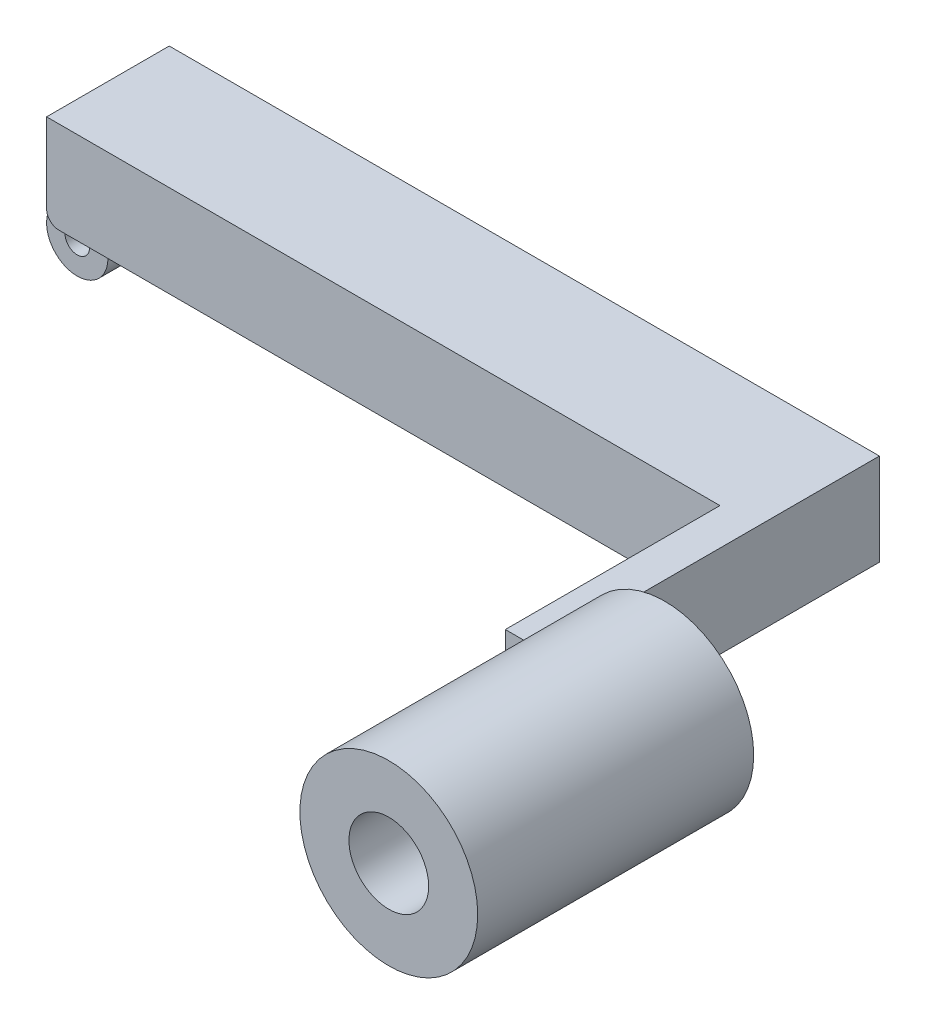
ISO-10303-21;
HEADER;
FILE_DESCRIPTION(('STEP AP214'),'2;1');
FILE_NAME('part.step','',(''),(''),'','','');
FILE_SCHEMA(('AUTOMOTIVE_DESIGN { 1 0 10303 214 1 1 1 1 }'));
ENDSEC;
DATA;
#1=APPLICATION_CONTEXT('core data for automotive mechanical design processes');
#2=APPLICATION_PROTOCOL_DEFINITION('international standard','automotive_design',2000,#1);
#3=PRODUCT_CONTEXT('',#1,'mechanical');
#4=PRODUCT('Part','Part','',(#3));
#5=PRODUCT_RELATED_PRODUCT_CATEGORY('part','',(#4));
#6=PRODUCT_DEFINITION_FORMATION('','',#4);
#7=PRODUCT_DEFINITION_CONTEXT('part definition',#1,'design');
#8=PRODUCT_DEFINITION('design','',#6,#7);
#9=PRODUCT_DEFINITION_SHAPE('','',#8);
#10=(LENGTH_UNIT() NAMED_UNIT(*) SI_UNIT(.MILLI.,.METRE.));
#11=(NAMED_UNIT(*) PLANE_ANGLE_UNIT() SI_UNIT($,.RADIAN.));
#12=(NAMED_UNIT(*) SI_UNIT($,.STERADIAN.) SOLID_ANGLE_UNIT());
#13=UNCERTAINTY_MEASURE_WITH_UNIT(LENGTH_MEASURE(1.E-05),#10,'distance_accuracy_value','');
#14=(GEOMETRIC_REPRESENTATION_CONTEXT(3) GLOBAL_UNCERTAINTY_ASSIGNED_CONTEXT((#13)) GLOBAL_UNIT_ASSIGNED_CONTEXT((#10,
#11,#12)) REPRESENTATION_CONTEXT('',''));
#15=CARTESIAN_POINT('',(0.,0.,0.));
#16=DIRECTION('',(0.,0.,1.));
#17=DIRECTION('',(1.,0.,0.));
#18=AXIS2_PLACEMENT_3D('',#15,#16,#17);
#19=CARTESIAN_POINT('',(115.8,7.5,10.));
#20=DIRECTION('',(0.,-1.,0.));
#21=DIRECTION('',(0.,0.,-1.));
#22=AXIS2_PLACEMENT_3D('',#19,#20,#21);
#23=PLANE('',#22);
#24=DIRECTION('',(0.,0.,-1.));
#25=VECTOR('',#24,1.);
#26=CARTESIAN_POINT('',(113.390326354009,7.5,80.));
#27=LINE('',#26,#25);
#28=CARTESIAN_POINT('',(113.390326354009,7.5,35.));
#29=VERTEX_POINT('',#28);
#30=CARTESIAN_POINT('',(113.390326354009,7.5,45.));
#31=VERTEX_POINT('',#30);
#32=EDGE_CURVE('E179',#29,#31,#27,.F.);
#33=ORIENTED_EDGE('',*,*,#32,.F.);
#34=DIRECTION('',(-1.,0.,0.));
#35=VECTOR('',#34,1.);
#36=CARTESIAN_POINT('',(115.8,7.5,35.));
#37=LINE('',#36,#35);
#38=CARTESIAN_POINT('',(115.8,7.5,35.));
#39=VERTEX_POINT('',#38);
#40=EDGE_CURVE('E185',#39,#29,#37,.T.);
#41=ORIENTED_EDGE('',*,*,#40,.F.);
#42=DIRECTION('',(0.,0.,1.));
#43=VECTOR('',#42,1.);
#44=CARTESIAN_POINT('',(115.8,7.5,10.));
#45=LINE('',#44,#43);
#46=CARTESIAN_POINT('',(115.8,7.5,-10.));
#47=VERTEX_POINT('',#46);
#48=EDGE_CURVE('E207',#47,#39,#45,.T.);
#49=ORIENTED_EDGE('',*,*,#48,.F.);
#50=DIRECTION('',(-1.,0.,0.));
#51=VECTOR('',#50,1.);
#52=CARTESIAN_POINT('',(115.8,7.5,-10.));
#53=LINE('',#52,#51);
#54=CARTESIAN_POINT('',(0.,7.5,-10.));
#55=VERTEX_POINT('',#54);
#56=EDGE_CURVE('E227',#47,#55,#53,.T.);
#57=ORIENTED_EDGE('',*,*,#56,.T.);
#58=DIRECTION('',(0.,0.,1.));
#59=VECTOR('',#58,1.);
#60=CARTESIAN_POINT('',(0.,7.5,10.));
#61=LINE('',#60,#59);
#62=CARTESIAN_POINT('',(0.,7.5,10.));
#63=VERTEX_POINT('',#62);
#64=EDGE_CURVE('E215',#55,#63,#61,.T.);
#65=ORIENTED_EDGE('',*,*,#64,.T.);
#66=DIRECTION('',(-1.,0.,0.));
#67=VECTOR('',#66,1.);
#68=CARTESIAN_POINT('',(115.8,7.5,10.));
#69=LINE('',#68,#67);
#70=CARTESIAN_POINT('',(109.8,7.5,10.));
#71=VERTEX_POINT('',#70);
#72=EDGE_CURVE('E225',#71,#63,#69,.T.);
#73=ORIENTED_EDGE('',*,*,#72,.F.);
#74=DIRECTION('',(0.,0.,-1.));
#75=VECTOR('',#74,1.);
#76=CARTESIAN_POINT('',(109.8,7.5,45.));
#77=LINE('',#76,#75);
#78=CARTESIAN_POINT('',(109.8,7.5,45.));
#79=VERTEX_POINT('',#78);
#80=EDGE_CURVE('E200',#79,#71,#77,.T.);
#81=ORIENTED_EDGE('',*,*,#80,.F.);
#82=DIRECTION('',(-1.,0.,0.));
#83=VECTOR('',#82,1.);
#84=CARTESIAN_POINT('',(115.8,7.5,45.));
#85=LINE('',#84,#83);
#86=EDGE_CURVE('E189',#31,#79,#85,.T.);
#87=ORIENTED_EDGE('',*,*,#86,.F.);
#88=EDGE_LOOP('',(#33,#41,#49,#57,#65,#73,#81,#87));
#89=FACE_BOUND('',#88,.T.);
#90=ADVANCED_FACE('F37',(#89),#23,.F.);
#91=CARTESIAN_POINT('',(115.8,-7.5,10.));
#92=DIRECTION('',(0.,1.,0.));
#93=DIRECTION('',(0.,0.,1.));
#94=AXIS2_PLACEMENT_3D('',#91,#92,#93);
#95=PLANE('',#94);
#96=DIRECTION('',(-1.,0.,0.));
#97=VECTOR('',#96,1.);
#98=CARTESIAN_POINT('',(0.,-7.5,-5.));
#99=LINE('',#98,#97);
#100=CARTESIAN_POINT('',(5.,-7.5,-5.));
#101=VERTEX_POINT('',#100);
#102=CARTESIAN_POINT('',(2.,-7.5,-5.));
#103=VERTEX_POINT('',#102);
#104=EDGE_CURVE('E155',#101,#103,#99,.T.);
#105=ORIENTED_EDGE('',*,*,#104,.T.);
#106=DIRECTION('',(0.,0.,-1.));
#107=VECTOR('',#106,1.);
#108=CARTESIAN_POINT('',(2.,-7.5,-10.));
#109=LINE('',#108,#107);
#110=CARTESIAN_POINT('',(2.00000000000003,-7.5,-10.));
#111=VERTEX_POINT('',#110);
#112=EDGE_CURVE('E239',#103,#111,#109,.T.);
#113=ORIENTED_EDGE('',*,*,#112,.T.);
#114=DIRECTION('',(-1.,0.,0.));
#115=VECTOR('',#114,1.);
#116=CARTESIAN_POINT('',(115.8,-7.5,-10.));
#117=LINE('',#116,#115);
#118=CARTESIAN_POINT('',(115.8,-7.5,-10.));
#119=VERTEX_POINT('',#118);
#120=EDGE_CURVE('E213',#119,#111,#117,.T.);
#121=ORIENTED_EDGE('',*,*,#120,.F.);
#122=DIRECTION('',(0.,0.,-1.));
#123=VECTOR('',#122,1.);
#124=CARTESIAN_POINT('',(115.8,-7.5,10.));
#125=LINE('',#124,#123);
#126=CARTESIAN_POINT('',(115.8,-7.5,35.));
#127=VERTEX_POINT('',#126);
#128=EDGE_CURVE('E211',#127,#119,#125,.T.);
#129=ORIENTED_EDGE('',*,*,#128,.F.);
#130=DIRECTION('',(1.,0.,0.));
#131=VECTOR('',#130,1.);
#132=CARTESIAN_POINT('',(115.8,-7.5,35.));
#133=LINE('',#132,#131);
#134=CARTESIAN_POINT('',(113.390326354009,-7.5,35.));
#135=VERTEX_POINT('',#134);
#136=EDGE_CURVE('E182',#135,#127,#133,.T.);
#137=ORIENTED_EDGE('',*,*,#136,.F.);
#138=DIRECTION('',(0.,0.,-1.));
#139=VECTOR('',#138,1.);
#140=CARTESIAN_POINT('',(113.390326354009,-7.5,80.));
#141=LINE('',#140,#139);
#142=CARTESIAN_POINT('',(113.390326354009,-7.5,45.));
#143=VERTEX_POINT('',#142);
#144=EDGE_CURVE('E176',#143,#135,#141,.T.);
#145=ORIENTED_EDGE('',*,*,#144,.F.);
#146=DIRECTION('',(1.,0.,0.));
#147=VECTOR('',#146,1.);
#148=CARTESIAN_POINT('',(115.8,-7.5,45.));
#149=LINE('',#148,#147);
#150=CARTESIAN_POINT('',(109.8,-7.5,45.));
#151=VERTEX_POINT('',#150);
#152=EDGE_CURVE('E193',#151,#143,#149,.T.);
#153=ORIENTED_EDGE('',*,*,#152,.F.);
#154=DIRECTION('',(0.,0.,-1.));
#155=VECTOR('',#154,1.);
#156=CARTESIAN_POINT('',(109.8,-7.5,45.));
#157=LINE('',#156,#155);
#158=CARTESIAN_POINT('',(109.8,-7.5,10.));
#159=VERTEX_POINT('',#158);
#160=EDGE_CURVE('E195',#151,#159,#157,.T.);
#161=ORIENTED_EDGE('',*,*,#160,.T.);
#162=DIRECTION('',(-1.,0.,0.));
#163=VECTOR('',#162,1.);
#164=CARTESIAN_POINT('',(115.8,-7.5,10.));
#165=LINE('',#164,#163);
#166=CARTESIAN_POINT('',(2.00000000000003,-7.5,10.));
#167=VERTEX_POINT('',#166);
#168=EDGE_CURVE('E222',#159,#167,#165,.T.);
#169=ORIENTED_EDGE('',*,*,#168,.T.);
#170=DIRECTION('',(0.,0.,-1.));
#171=VECTOR('',#170,1.);
#172=CARTESIAN_POINT('',(2.,-7.5,5.));
#173=LINE('',#172,#171);
#174=CARTESIAN_POINT('',(2.,-7.5,5.));
#175=VERTEX_POINT('',#174);
#176=EDGE_CURVE('E236',#167,#175,#173,.T.);
#177=ORIENTED_EDGE('',*,*,#176,.T.);
#178=DIRECTION('',(-1.,0.,0.));
#179=VECTOR('',#178,1.);
#180=CARTESIAN_POINT('',(0.,-7.5,5.));
#181=LINE('',#180,#179);
#182=CARTESIAN_POINT('',(5.,-7.5,5.));
#183=VERTEX_POINT('',#182);
#184=EDGE_CURVE('E147',#183,#175,#181,.T.);
#185=ORIENTED_EDGE('',*,*,#184,.F.);
#186=DIRECTION('',(0.,0.,-1.));
#187=VECTOR('',#186,1.);
#188=CARTESIAN_POINT('',(5.,-7.5,5.));
#189=LINE('',#188,#187);
#190=EDGE_CURVE('E145',#183,#101,#189,.T.);
#191=ORIENTED_EDGE('',*,*,#190,.T.);
#192=EDGE_LOOP('',(#105,#113,#121,#129,#137,#145,#153,#161,#169,#177,#185,#191));
#193=FACE_BOUND('',#192,.T.);
#194=ADVANCED_FACE('F260',(#193),#95,.F.);
#195=CARTESIAN_POINT('',(115.8,0.,0.));
#196=DIRECTION('',(-1.,0.,0.));
#197=DIRECTION('',(0.,0.,1.));
#198=AXIS2_PLACEMENT_3D('',#195,#196,#197);
#199=PLANE('',#198);
#200=DIRECTION('',(0.,1.,0.));
#201=VECTOR('',#200,1.);
#202=CARTESIAN_POINT('',(115.8,0.,35.));
#203=LINE('',#202,#201);
#204=EDGE_CURVE('E233',#127,#39,#203,.T.);
#205=ORIENTED_EDGE('',*,*,#204,.F.);
#206=ORIENTED_EDGE('',*,*,#128,.T.);
#207=DIRECTION('',(0.,1.,0.));
#208=VECTOR('',#207,1.);
#209=CARTESIAN_POINT('',(115.8,-7.5,-10.));
#210=LINE('',#209,#208);
#211=EDGE_CURVE('E204',#119,#47,#210,.T.);
#212=ORIENTED_EDGE('',*,*,#211,.T.);
#213=ORIENTED_EDGE('',*,*,#48,.T.);
#214=EDGE_LOOP('',(#205,#206,#212,#213));
#215=FACE_BOUND('',#214,.T.);
#216=ADVANCED_FACE('F277',(#215),#199,.F.);
#217=CARTESIAN_POINT('',(115.8,-7.5,10.));
#218=DIRECTION('',(0.,0.,-1.));
#219=DIRECTION('',(-1.,0.,0.));
#220=AXIS2_PLACEMENT_3D('',#217,#218,#219);
#221=PLANE('',#220);
#222=DIRECTION('',(0.,-1.,0.));
#223=VECTOR('',#222,1.);
#224=CARTESIAN_POINT('',(0.,-7.5,10.));
#225=LINE('',#224,#223);
#226=CARTESIAN_POINT('',(0.,-5.5,10.));
#227=VERTEX_POINT('',#226);
#228=EDGE_CURVE('E208',#63,#227,#225,.T.);
#229=ORIENTED_EDGE('',*,*,#228,.T.);
#230=CARTESIAN_POINT('',(2.,-5.5,10.));
#231=DIRECTION('',(0.,0.,-1.));
#232=DIRECTION('',(-1.,0.,0.));
#233=AXIS2_PLACEMENT_3D('',#230,#231,#232);
#234=CIRCLE('',#233,2.);
#235=EDGE_CURVE('E250',#227,#167,#234,.F.);
#236=ORIENTED_EDGE('',*,*,#235,.T.);
#237=ORIENTED_EDGE('',*,*,#168,.F.);
#238=DIRECTION('',(0.,-1.,0.));
#239=VECTOR('',#238,1.);
#240=CARTESIAN_POINT('',(109.8,7.5,10.));
#241=LINE('',#240,#239);
#242=EDGE_CURVE('E188',#71,#159,#241,.T.);
#243=ORIENTED_EDGE('',*,*,#242,.F.);
#244=ORIENTED_EDGE('',*,*,#72,.T.);
#245=EDGE_LOOP('',(#229,#236,#237,#243,#244));
#246=FACE_BOUND('',#245,.T.);
#247=ADVANCED_FACE('F295',(#246),#221,.F.);
#248=CARTESIAN_POINT('',(115.8,-7.5,-10.));
#249=DIRECTION('',(0.,0.,1.));
#250=DIRECTION('',(1.,0.,0.));
#251=AXIS2_PLACEMENT_3D('',#248,#249,#250);
#252=PLANE('',#251);
#253=ORIENTED_EDGE('',*,*,#120,.T.);
#254=CARTESIAN_POINT('',(2.,-5.5,-10.));
#255=DIRECTION('',(0.,0.,1.));
#256=DIRECTION('',(1.,0.,0.));
#257=AXIS2_PLACEMENT_3D('',#254,#255,#256);
#258=CIRCLE('',#257,2.);
#259=CARTESIAN_POINT('',(0.,-5.5,-10.));
#260=VERTEX_POINT('',#259);
#261=EDGE_CURVE('E242',#111,#260,#258,.F.);
#262=ORIENTED_EDGE('',*,*,#261,.T.);
#263=DIRECTION('',(0.,1.,0.));
#264=VECTOR('',#263,1.);
#265=CARTESIAN_POINT('',(0.,-7.5,-10.));
#266=LINE('',#265,#264);
#267=EDGE_CURVE('E203',#260,#55,#266,.T.);
#268=ORIENTED_EDGE('',*,*,#267,.T.);
#269=ORIENTED_EDGE('',*,*,#56,.F.);
#270=ORIENTED_EDGE('',*,*,#211,.F.);
#271=EDGE_LOOP('',(#253,#262,#268,#269,#270));
#272=FACE_BOUND('',#271,.T.);
#273=ADVANCED_FACE('F267',(#272),#252,.F.);
#274=CARTESIAN_POINT('',(0.,0.,0.));
#275=DIRECTION('',(-1.,0.,0.));
#276=DIRECTION('',(0.,0.,1.));
#277=AXIS2_PLACEMENT_3D('',#274,#275,#276);
#278=PLANE('',#277);
#279=ORIENTED_EDGE('',*,*,#267,.F.);
#280=DIRECTION('',(0.,0.,-1.));
#281=VECTOR('',#280,1.);
#282=CARTESIAN_POINT('',(0.,-5.5,-5.));
#283=LINE('',#282,#281);
#284=CARTESIAN_POINT('',(0.,-5.5,-5.));
#285=VERTEX_POINT('',#284);
#286=EDGE_CURVE('E248',#260,#285,#283,.F.);
#287=ORIENTED_EDGE('',*,*,#286,.T.);
#288=DIRECTION('',(0.,-1.,0.));
#289=VECTOR('',#288,1.);
#290=CARTESIAN_POINT('',(0.,-12.5,-5.));
#291=LINE('',#290,#289);
#292=CARTESIAN_POINT('',(0.,-7.5,-5.));
#293=VERTEX_POINT('',#292);
#294=EDGE_CURVE('E59',#285,#293,#291,.T.);
#295=ORIENTED_EDGE('',*,*,#294,.T.);
#296=DIRECTION('',(0.,0.,-1.));
#297=VECTOR('',#296,1.);
#298=CARTESIAN_POINT('',(0.,-7.5,5.));
#299=LINE('',#298,#297);
#300=CARTESIAN_POINT('',(0.,-7.5,5.));
#301=VERTEX_POINT('',#300);
#302=EDGE_CURVE('E164',#301,#293,#299,.T.);
#303=ORIENTED_EDGE('',*,*,#302,.F.);
#304=DIRECTION('',(0.,1.,0.));
#305=VECTOR('',#304,1.);
#306=CARTESIAN_POINT('',(0.,0.,5.));
#307=LINE('',#306,#305);
#308=CARTESIAN_POINT('',(0.,-5.5,5.));
#309=VERTEX_POINT('',#308);
#310=EDGE_CURVE('E51',#301,#309,#307,.T.);
#311=ORIENTED_EDGE('',*,*,#310,.T.);
#312=DIRECTION('',(0.,0.,-1.));
#313=VECTOR('',#312,1.);
#314=CARTESIAN_POINT('',(0.,-5.5,10.));
#315=LINE('',#314,#313);
#316=EDGE_CURVE('E244',#309,#227,#315,.F.);
#317=ORIENTED_EDGE('',*,*,#316,.T.);
#318=ORIENTED_EDGE('',*,*,#228,.F.);
#319=ORIENTED_EDGE('',*,*,#64,.F.);
#320=EDGE_LOOP('',(#279,#287,#295,#303,#311,#317,#318,#319));
#321=FACE_BOUND('',#320,.T.);
#322=ADVANCED_FACE('F272',(#321),#278,.T.);
#323=CARTESIAN_POINT('',(109.8,7.5,45.));
#324=DIRECTION('',(1.,0.,0.));
#325=DIRECTION('',(0.,0.,-1.));
#326=AXIS2_PLACEMENT_3D('',#323,#324,#325);
#327=PLANE('',#326);
#328=ORIENTED_EDGE('',*,*,#242,.T.);
#329=ORIENTED_EDGE('',*,*,#160,.F.);
#330=DIRECTION('',(0.,-1.,0.));
#331=VECTOR('',#330,1.);
#332=CARTESIAN_POINT('',(109.8,7.5,45.));
#333=LINE('',#332,#331);
#334=EDGE_CURVE('E191',#79,#151,#333,.T.);
#335=ORIENTED_EDGE('',*,*,#334,.F.);
#336=ORIENTED_EDGE('',*,*,#80,.T.);
#337=EDGE_LOOP('',(#328,#329,#335,#336));
#338=FACE_BOUND('',#337,.T.);
#339=ADVANCED_FACE('F293',(#338),#327,.F.);
#340=CARTESIAN_POINT('',(0.,0.,45.));
#341=DIRECTION('',(0.,0.,-1.));
#342=DIRECTION('',(-1.,0.,0.));
#343=AXIS2_PLACEMENT_3D('',#340,#341,#342);
#344=PLANE('',#343);
#345=CARTESIAN_POINT('',(125.8,0.,45.));
#346=DIRECTION('',(0.,0.,-1.));
#347=DIRECTION('',(-1.,0.,0.));
#348=AXIS2_PLACEMENT_3D('',#345,#346,#347);
#349=CIRCLE('',#348,14.5);
#350=EDGE_CURVE('E230',#31,#143,#349,.F.);
#351=ORIENTED_EDGE('',*,*,#350,.F.);
#352=ORIENTED_EDGE('',*,*,#86,.T.);
#353=ORIENTED_EDGE('',*,*,#334,.T.);
#354=ORIENTED_EDGE('',*,*,#152,.T.);
#355=EDGE_LOOP('',(#351,#352,#353,#354));
#356=FACE_BOUND('',#355,.T.);
#357=ADVANCED_FACE('F288',(#356),#344,.F.);
#358=CARTESIAN_POINT('',(125.8,0.,35.));
#359=DIRECTION('',(0.,0.,1.));
#360=DIRECTION('',(1.,0.,0.));
#361=AXIS2_PLACEMENT_3D('',#358,#359,#360);
#362=PLANE('',#361);
#363=CARTESIAN_POINT('',(125.8,0.,35.));
#364=DIRECTION('',(0.,0.,1.));
#365=DIRECTION('',(1.,0.,0.));
#366=AXIS2_PLACEMENT_3D('',#363,#364,#365);
#367=CIRCLE('',#366,6.50000000000002);
#368=CARTESIAN_POINT('',(132.3,0.,35.));
#369=VERTEX_POINT('',#368);
#370=EDGE_CURVE('E159',#369,#369,#367,.T.);
#371=ORIENTED_EDGE('',*,*,#370,.T.);
#372=EDGE_LOOP('',(#371));
#373=FACE_BOUND('',#372,.T.);
#374=ORIENTED_EDGE('',*,*,#204,.T.);
#375=ORIENTED_EDGE('',*,*,#40,.T.);
#376=CARTESIAN_POINT('',(125.8,0.,35.));
#377=DIRECTION('',(0.,0.,1.));
#378=DIRECTION('',(1.,0.,0.));
#379=AXIS2_PLACEMENT_3D('',#376,#377,#378);
#380=CIRCLE('',#379,14.5);
#381=EDGE_CURVE('E162',#135,#29,#380,.T.);
#382=ORIENTED_EDGE('',*,*,#381,.F.);
#383=ORIENTED_EDGE('',*,*,#136,.T.);
#384=EDGE_LOOP('',(#374,#375,#382,#383));
#385=FACE_BOUND('',#384,.T.);
#386=ADVANCED_FACE('F282',(#373,#385),#362,.F.);
#387=CARTESIAN_POINT('',(125.8,0.,80.));
#388=DIRECTION('',(0.,0.,-1.));
#389=DIRECTION('',(-1.,0.,0.));
#390=AXIS2_PLACEMENT_3D('',#387,#388,#389);
#391=CYLINDRICAL_SURFACE('',#390,14.5);
#392=CARTESIAN_POINT('',(125.8,0.,80.));
#393=DIRECTION('',(0.,0.,1.));
#394=DIRECTION('',(1.,0.,0.));
#395=AXIS2_PLACEMENT_3D('',#392,#393,#394);
#396=CIRCLE('',#395,14.5);
#397=CARTESIAN_POINT('',(140.3,0.,80.));
#398=VERTEX_POINT('',#397);
#399=EDGE_CURVE('E173',#398,#398,#396,.T.);
#400=ORIENTED_EDGE('',*,*,#399,.F.);
#401=EDGE_LOOP('',(#400));
#402=FACE_BOUND('',#401,.T.);
#403=ORIENTED_EDGE('',*,*,#381,.T.);
#404=ORIENTED_EDGE('',*,*,#32,.T.);
#405=ORIENTED_EDGE('',*,*,#350,.T.);
#406=ORIENTED_EDGE('',*,*,#144,.T.);
#407=EDGE_LOOP('',(#403,#404,#405,#406));
#408=FACE_BOUND('',#407,.T.);
#409=ADVANCED_FACE('F284',(#402,#408),#391,.T.);
#410=CARTESIAN_POINT('',(125.8,0.,80.));
#411=DIRECTION('',(0.,0.,1.));
#412=DIRECTION('',(1.,0.,0.));
#413=AXIS2_PLACEMENT_3D('',#410,#411,#412);
#414=PLANE('',#413);
#415=ORIENTED_EDGE('',*,*,#399,.T.);
#416=EDGE_LOOP('',(#415));
#417=FACE_BOUND('',#416,.T.);
#418=CARTESIAN_POINT('',(125.8,0.,80.));
#419=DIRECTION('',(0.,0.,1.));
#420=DIRECTION('',(1.,0.,0.));
#421=AXIS2_PLACEMENT_3D('',#418,#419,#420);
#422=CIRCLE('',#421,6.50000000000002);
#423=CARTESIAN_POINT('',(132.3,0.,80.));
#424=VERTEX_POINT('',#423);
#425=EDGE_CURVE('E170',#424,#424,#422,.T.);
#426=ORIENTED_EDGE('',*,*,#425,.F.);
#427=EDGE_LOOP('',(#426));
#428=FACE_BOUND('',#427,.T.);
#429=ADVANCED_FACE('F321',(#417,#428),#414,.T.);
#430=CARTESIAN_POINT('',(125.8,0.,80.));
#431=DIRECTION('',(0.,0.,-1.));
#432=DIRECTION('',(-1.,0.,0.));
#433=AXIS2_PLACEMENT_3D('',#430,#431,#432);
#434=CYLINDRICAL_SURFACE('',#433,6.50000000000002);
#435=ORIENTED_EDGE('',*,*,#425,.T.);
#436=EDGE_LOOP('',(#435));
#437=FACE_BOUND('',#436,.T.);
#438=ORIENTED_EDGE('',*,*,#370,.F.);
#439=EDGE_LOOP('',(#438));
#440=FACE_BOUND('',#439,.T.);
#441=ADVANCED_FACE('F314',(#437,#440),#434,.F.);
#442=CARTESIAN_POINT('',(0.,-12.5,5.));
#443=DIRECTION('',(0.,0.,1.));
#444=DIRECTION('',(1.,0.,0.));
#445=AXIS2_PLACEMENT_3D('',#442,#443,#444);
#446=PLANE('',#445);
#447=CARTESIAN_POINT('',(0.,-12.5,5.));
#448=DIRECTION('',(0.,0.,1.));
#449=DIRECTION('',(1.,0.,0.));
#450=AXIS2_PLACEMENT_3D('',#447,#448,#449);
#451=CIRCLE('',#450,5.);
#452=CARTESIAN_POINT('',(5.,-12.5,5.));
#453=VERTEX_POINT('',#452);
#454=EDGE_CURVE('E148',#301,#453,#451,.T.);
#455=ORIENTED_EDGE('',*,*,#454,.T.);
#456=DIRECTION('',(0.,1.,0.));
#457=VECTOR('',#456,1.);
#458=CARTESIAN_POINT('',(5.,-12.5,5.));
#459=LINE('',#458,#457);
#460=EDGE_CURVE('E139',#453,#183,#459,.T.);
#461=ORIENTED_EDGE('',*,*,#460,.T.);
#462=ORIENTED_EDGE('',*,*,#184,.T.);
#463=CARTESIAN_POINT('',(2.,-5.5,5.));
#464=DIRECTION('',(0.,0.,1.));
#465=DIRECTION('',(1.,0.,0.));
#466=AXIS2_PLACEMENT_3D('',#463,#464,#465);
#467=CIRCLE('',#466,2.);
#468=EDGE_CURVE('E11',#175,#309,#467,.F.);
#469=ORIENTED_EDGE('',*,*,#468,.T.);
#470=ORIENTED_EDGE('',*,*,#310,.F.);
#471=EDGE_LOOP('',(#455,#461,#462,#469,#470));
#472=FACE_BOUND('',#471,.T.);
#473=CARTESIAN_POINT('',(0.,-12.5,5.));
#474=DIRECTION('',(0.,0.,1.));
#475=DIRECTION('',(1.,0.,0.));
#476=AXIS2_PLACEMENT_3D('',#473,#474,#475);
#477=CIRCLE('',#476,2.);
#478=CARTESIAN_POINT('',(2.,-12.5,5.));
#479=VERTEX_POINT('',#478);
#480=EDGE_CURVE('E303',#479,#479,#477,.T.);
#481=ORIENTED_EDGE('',*,*,#480,.F.);
#482=EDGE_LOOP('',(#481));
#483=FACE_BOUND('',#482,.T.);
#484=ADVANCED_FACE('F151',(#472,#483),#446,.T.);
#485=CARTESIAN_POINT('',(0.,-12.5,-5.));
#486=DIRECTION('',(0.,0.,1.));
#487=DIRECTION('',(1.,0.,0.));
#488=AXIS2_PLACEMENT_3D('',#485,#486,#487);
#489=PLANE('',#488);
#490=CARTESIAN_POINT('',(0.,-12.5,-5.));
#491=DIRECTION('',(0.,0.,1.));
#492=DIRECTION('',(1.,0.,0.));
#493=AXIS2_PLACEMENT_3D('',#490,#491,#492);
#494=CIRCLE('',#493,5.);
#495=CARTESIAN_POINT('',(5.,-12.5,-5.));
#496=VERTEX_POINT('',#495);
#497=EDGE_CURVE('E158',#293,#496,#494,.T.);
#498=ORIENTED_EDGE('',*,*,#497,.F.);
#499=ORIENTED_EDGE('',*,*,#294,.F.);
#500=CARTESIAN_POINT('',(2.,-5.5,-5.));
#501=DIRECTION('',(0.,0.,1.));
#502=DIRECTION('',(1.,0.,0.));
#503=AXIS2_PLACEMENT_3D('',#500,#501,#502);
#504=CIRCLE('',#503,2.);
#505=EDGE_CURVE('E45',#285,#103,#504,.T.);
#506=ORIENTED_EDGE('',*,*,#505,.T.);
#507=ORIENTED_EDGE('',*,*,#104,.F.);
#508=DIRECTION('',(0.,1.,0.));
#509=VECTOR('',#508,1.);
#510=CARTESIAN_POINT('',(5.,-12.5,-5.));
#511=LINE('',#510,#509);
#512=EDGE_CURVE('E262',#496,#101,#511,.T.);
#513=ORIENTED_EDGE('',*,*,#512,.F.);
#514=EDGE_LOOP('',(#498,#499,#506,#507,#513));
#515=FACE_BOUND('',#514,.T.);
#516=CARTESIAN_POINT('',(0.,-12.5,-5.));
#517=DIRECTION('',(0.,0.,1.));
#518=DIRECTION('',(1.,0.,0.));
#519=AXIS2_PLACEMENT_3D('',#516,#517,#518);
#520=CIRCLE('',#519,2.);
#521=CARTESIAN_POINT('',(2.,-12.5,-5.));
#522=VERTEX_POINT('',#521);
#523=EDGE_CURVE('E305',#522,#522,#520,.T.);
#524=ORIENTED_EDGE('',*,*,#523,.T.);
#525=EDGE_LOOP('',(#524));
#526=FACE_BOUND('',#525,.T.);
#527=ADVANCED_FACE('F254',(#515,#526),#489,.F.);
#528=CARTESIAN_POINT('',(0.,-12.5,5.));
#529=DIRECTION('',(0.,0.,-1.));
#530=DIRECTION('',(-1.,0.,0.));
#531=AXIS2_PLACEMENT_3D('',#528,#529,#530);
#532=CYLINDRICAL_SURFACE('',#531,5.);
#533=ORIENTED_EDGE('',*,*,#497,.T.);
#534=DIRECTION('',(0.,0.,-1.));
#535=VECTOR('',#534,1.);
#536=CARTESIAN_POINT('',(5.,-12.5,5.));
#537=LINE('',#536,#535);
#538=EDGE_CURVE('E143',#453,#496,#537,.T.);
#539=ORIENTED_EDGE('',*,*,#538,.F.);
#540=ORIENTED_EDGE('',*,*,#454,.F.);
#541=ORIENTED_EDGE('',*,*,#302,.T.);
#542=EDGE_LOOP('',(#533,#539,#540,#541));
#543=FACE_BOUND('',#542,.T.);
#544=ADVANCED_FACE('F157',(#543),#532,.T.);
#545=CARTESIAN_POINT('',(5.,-12.5,5.));
#546=DIRECTION('',(-1.,0.,0.));
#547=DIRECTION('',(0.,-1.,0.));
#548=AXIS2_PLACEMENT_3D('',#545,#546,#547);
#549=PLANE('',#548);
#550=ORIENTED_EDGE('',*,*,#512,.T.);
#551=ORIENTED_EDGE('',*,*,#190,.F.);
#552=ORIENTED_EDGE('',*,*,#460,.F.);
#553=ORIENTED_EDGE('',*,*,#538,.T.);
#554=EDGE_LOOP('',(#550,#551,#552,#553));
#555=FACE_BOUND('',#554,.T.);
#556=ADVANCED_FACE('F141',(#555),#549,.F.);
#557=CARTESIAN_POINT('',(0.,-12.5,5.));
#558=DIRECTION('',(0.,0.,-1.));
#559=DIRECTION('',(-1.,0.,0.));
#560=AXIS2_PLACEMENT_3D('',#557,#558,#559);
#561=CYLINDRICAL_SURFACE('',#560,2.);
#562=ORIENTED_EDGE('',*,*,#480,.T.);
#563=EDGE_LOOP('',(#562));
#564=FACE_BOUND('',#563,.T.);
#565=ORIENTED_EDGE('',*,*,#523,.F.);
#566=EDGE_LOOP('',(#565));
#567=FACE_BOUND('',#566,.T.);
#568=ADVANCED_FACE('F311',(#564,#567),#561,.F.);
#569=CARTESIAN_POINT('',(2.,-5.5,10.));
#570=DIRECTION('',(0.,0.,1.));
#571=DIRECTION('',(1.,0.,0.));
#572=AXIS2_PLACEMENT_3D('',#569,#570,#571);
#573=CYLINDRICAL_SURFACE('',#572,2.);
#574=ORIENTED_EDGE('',*,*,#505,.F.);
#575=ORIENTED_EDGE('',*,*,#286,.F.);
#576=ORIENTED_EDGE('',*,*,#261,.F.);
#577=ORIENTED_EDGE('',*,*,#112,.F.);
#578=EDGE_LOOP('',(#574,#575,#576,#577));
#579=FACE_BOUND('',#578,.T.);
#580=ADVANCED_FACE('F264',(#579),#573,.T.);
#581=CARTESIAN_POINT('',(2.,-5.5,10.));
#582=DIRECTION('',(0.,0.,1.));
#583=DIRECTION('',(1.,0.,0.));
#584=AXIS2_PLACEMENT_3D('',#581,#582,#583);
#585=CYLINDRICAL_SURFACE('',#584,2.);
#586=ORIENTED_EDGE('',*,*,#235,.F.);
#587=ORIENTED_EDGE('',*,*,#316,.F.);
#588=ORIENTED_EDGE('',*,*,#468,.F.);
#589=ORIENTED_EDGE('',*,*,#176,.F.);
#590=EDGE_LOOP('',(#586,#587,#588,#589));
#591=FACE_BOUND('',#590,.T.);
#592=ADVANCED_FACE('F39',(#591),#585,.T.);
#593=CLOSED_SHELL('',(#90,#194,#216,#247,#273,#322,#339,#357,#386,#409,#429,#441,#484,#527,#544,
#556,#568,#580,#592));
#594=MANIFOLD_SOLID_BREP('B2',#593);
#595=ADVANCED_BREP_SHAPE_REPRESENTATION('',(#18,#594),#14);
#596=SHAPE_DEFINITION_REPRESENTATION(#9,#595);
ENDSEC;
END-ISO-10303-21;
